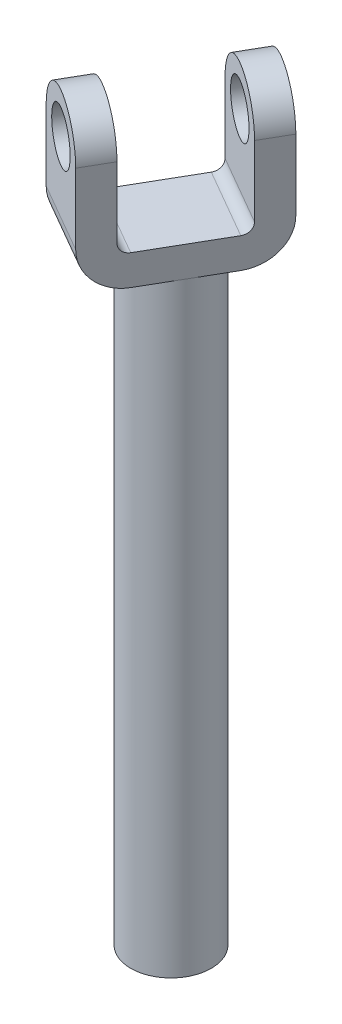
ISO-10303-21;
HEADER;
FILE_DESCRIPTION(('STEP AP214'),'2;1');
FILE_NAME('part.step','',(''),(''),'','','');
FILE_SCHEMA(('AUTOMOTIVE_DESIGN { 1 0 10303 214 1 1 1 1 }'));
ENDSEC;
DATA;
#1=APPLICATION_CONTEXT('core data for automotive mechanical design processes');
#2=APPLICATION_PROTOCOL_DEFINITION('international standard','automotive_design',2000,#1);
#3=PRODUCT_CONTEXT('',#1,'mechanical');
#4=PRODUCT('Part','Part','',(#3));
#5=PRODUCT_RELATED_PRODUCT_CATEGORY('part','',(#4));
#6=PRODUCT_DEFINITION_FORMATION('','',#4);
#7=PRODUCT_DEFINITION_CONTEXT('part definition',#1,'design');
#8=PRODUCT_DEFINITION('design','',#6,#7);
#9=PRODUCT_DEFINITION_SHAPE('','',#8);
#10=(LENGTH_UNIT() NAMED_UNIT(*) SI_UNIT(.MILLI.,.METRE.));
#11=(NAMED_UNIT(*) PLANE_ANGLE_UNIT() SI_UNIT($,.RADIAN.));
#12=(NAMED_UNIT(*) SI_UNIT($,.STERADIAN.) SOLID_ANGLE_UNIT());
#13=UNCERTAINTY_MEASURE_WITH_UNIT(LENGTH_MEASURE(1.E-05),#10,'distance_accuracy_value','');
#14=(GEOMETRIC_REPRESENTATION_CONTEXT(3) GLOBAL_UNCERTAINTY_ASSIGNED_CONTEXT((#13)) GLOBAL_UNIT_ASSIGNED_CONTEXT((#10,
#11,#12)) REPRESENTATION_CONTEXT('',''));
#15=CARTESIAN_POINT('',(0.,0.,0.));
#16=DIRECTION('',(0.,0.,1.));
#17=DIRECTION('',(1.,0.,0.));
#18=AXIS2_PLACEMENT_3D('',#15,#16,#17);
#19=CARTESIAN_POINT('',(30.34635,71.3137084989848,-52.5614200242678));
#20=DIRECTION('',(0.,-1.,0.));
#21=DIRECTION('',(0.,0.,-1.));
#22=AXIS2_PLACEMENT_3D('',#19,#20,#21);
#23=CYLINDRICAL_SURFACE('',#22,4.);
#24=CARTESIAN_POINT('',(30.34635,0.,-52.5614200242678));
#25=DIRECTION('',(0.,1.,0.));
#26=DIRECTION('',(0.,0.,1.));
#27=AXIS2_PLACEMENT_3D('',#24,#25,#26);
#28=CIRCLE('',#27,4.);
#29=CARTESIAN_POINT('',(30.34635,0.,-48.5614200242678));
#30=VERTEX_POINT('',#29);
#31=EDGE_CURVE('E264',#30,#30,#28,.T.);
#32=ORIENTED_EDGE('',*,*,#31,.T.);
#33=EDGE_LOOP('',(#32));
#34=FACE_BOUND('',#33,.T.);
#35=CARTESIAN_POINT('',(30.34635,60.,-52.5614200242678));
#36=DIRECTION('',(0.,1.,0.));
#37=DIRECTION('',(0.,0.,1.));
#38=AXIS2_PLACEMENT_3D('',#35,#36,#37);
#39=CIRCLE('',#38,4.);
#40=CARTESIAN_POINT('',(33.8104516151378,60.,-50.5614200242678));
#41=VERTEX_POINT('',#40);
#42=CARTESIAN_POINT('',(32.34635,60.,-56.0255216394055));
#43=VERTEX_POINT('',#42);
#44=EDGE_CURVE('E269',#41,#43,#39,.T.);
#45=ORIENTED_EDGE('',*,*,#44,.F.);
#46=CARTESIAN_POINT('',(28.34635,60.,-49.09731840913));
#47=VERTEX_POINT('',#46);
#48=EDGE_CURVE('E268',#47,#41,#39,.T.);
#49=ORIENTED_EDGE('',*,*,#48,.F.);
#50=CARTESIAN_POINT('',(26.8822483848622,60.,-54.5614200242678));
#51=VERTEX_POINT('',#50);
#52=EDGE_CURVE('E314',#51,#47,#39,.T.);
#53=ORIENTED_EDGE('',*,*,#52,.F.);
#54=EDGE_CURVE('E272',#43,#51,#39,.T.);
#55=ORIENTED_EDGE('',*,*,#54,.F.);
#56=EDGE_LOOP('',(#45,#49,#53,#55));
#57=FACE_BOUND('',#56,.T.);
#58=ADVANCED_FACE('F47',(#34,#57),#23,.T.);
#59=CARTESIAN_POINT('',(30.34635,0.,-52.5614200242678));
#60=DIRECTION('',(0.,1.,0.));
#61=DIRECTION('',(0.,0.,1.));
#62=AXIS2_PLACEMENT_3D('',#59,#60,#61);
#63=PLANE('',#62);
#64=ORIENTED_EDGE('',*,*,#31,.F.);
#65=EDGE_LOOP('',(#64));
#66=FACE_BOUND('',#65,.T.);
#67=ADVANCED_FACE('F351',(#66),#63,.F.);
#68=CARTESIAN_POINT('',(28.8822483848622,60.,-58.0255216394055));
#69=DIRECTION('',(0.,1.,0.));
#70=DIRECTION('',(0.,0.,1.));
#71=AXIS2_PLACEMENT_3D('',#68,#69,#70);
#72=PLANE('',#71);
#73=DIRECTION('',(-0.5,0.,0.866025403784439));
#74=VECTOR('',#73,1.);
#75=CARTESIAN_POINT('',(35.8104516151377,60.,-54.0255216394055));
#76=LINE('',#75,#74);
#77=CARTESIAN_POINT('',(35.8104516151377,60.,-54.0255216394055));
#78=VERTEX_POINT('',#77);
#79=EDGE_CURVE('E206',#78,#41,#76,.T.);
#80=ORIENTED_EDGE('',*,*,#79,.T.);
#81=ORIENTED_EDGE('',*,*,#44,.T.);
#82=DIRECTION('',(0.866025403784439,0.,0.5));
#83=VECTOR('',#82,1.);
#84=CARTESIAN_POINT('',(28.8822483848622,60.,-58.0255216394055));
#85=LINE('',#84,#83);
#86=EDGE_CURVE('E255',#43,#78,#85,.T.);
#87=ORIENTED_EDGE('',*,*,#86,.T.);
#88=EDGE_LOOP('',(#80,#81,#87));
#89=FACE_BOUND('',#88,.T.);
#90=ADVANCED_FACE('F326',(#89),#72,.F.);
#91=CARTESIAN_POINT('',(28.8822483848622,60.,-58.0255216394055));
#92=VERTEX_POINT('',#91);
#93=EDGE_CURVE('E256',#92,#43,#85,.T.);
#94=ORIENTED_EDGE('',*,*,#93,.T.);
#95=ORIENTED_EDGE('',*,*,#54,.T.);
#96=DIRECTION('',(-0.5,0.,0.866025403784439));
#97=VECTOR('',#96,1.);
#98=CARTESIAN_POINT('',(28.8822483848622,60.,-58.0255216394055));
#99=LINE('',#98,#97);
#100=EDGE_CURVE('E180',#92,#51,#99,.T.);
#101=ORIENTED_EDGE('',*,*,#100,.F.);
#102=EDGE_LOOP('',(#94,#95,#101));
#103=FACE_BOUND('',#102,.T.);
#104=ADVANCED_FACE('F365',(#103),#72,.F.);
#105=CARTESIAN_POINT('',(24.8822483848622,60.,-51.09731840913));
#106=VERTEX_POINT('',#105);
#107=EDGE_CURVE('E304',#51,#106,#99,.T.);
#108=ORIENTED_EDGE('',*,*,#107,.F.);
#109=ORIENTED_EDGE('',*,*,#52,.T.);
#110=DIRECTION('',(0.866025403784439,0.,0.5));
#111=VECTOR('',#110,1.);
#112=CARTESIAN_POINT('',(24.8822483848622,60.,-51.09731840913));
#113=LINE('',#112,#111);
#114=EDGE_CURVE('E251',#106,#47,#113,.T.);
#115=ORIENTED_EDGE('',*,*,#114,.F.);
#116=EDGE_LOOP('',(#108,#109,#115));
#117=FACE_BOUND('',#116,.T.);
#118=ADVANCED_FACE('F313',(#117),#72,.F.);
#119=CARTESIAN_POINT('',(30.8822483848622,75.,-61.4896232545433));
#120=DIRECTION('',(-0.5,0.,0.866025403784439));
#121=DIRECTION('',(0.866025403784439,0.,0.5));
#122=AXIS2_PLACEMENT_3D('',#119,#120,#121);
#123=PLANE('',#122);
#124=CARTESIAN_POINT('',(34.34635,71.,-59.4896232545433));
#125=DIRECTION('',(-0.5,0.,0.866025403784439));
#126=DIRECTION('',(0.866025403784439,0.,0.5));
#127=AXIS2_PLACEMENT_3D('',#124,#125,#126);
#128=CIRCLE('',#127,2.5);
#129=CARTESIAN_POINT('',(36.5114135094611,71.,-58.2396232545433));
#130=VERTEX_POINT('',#129);
#131=EDGE_CURVE('E201',#130,#130,#128,.T.);
#132=ORIENTED_EDGE('',*,*,#131,.T.);
#133=EDGE_LOOP('',(#132));
#134=FACE_BOUND('',#133,.T.);
#135=DIRECTION('',(0.,-1.,0.));
#136=VECTOR('',#135,1.);
#137=CARTESIAN_POINT('',(30.8822483848622,75.,-61.4896232545433));
#138=LINE('',#137,#136);
#139=CARTESIAN_POINT('',(30.8822483848622,71.,-61.4896232545433));
#140=VERTEX_POINT('',#139);
#141=CARTESIAN_POINT('',(30.8822483848622,64.,-61.4896232545433));
#142=VERTEX_POINT('',#141);
#143=EDGE_CURVE('E231',#140,#142,#138,.T.);
#144=ORIENTED_EDGE('',*,*,#143,.F.);
#145=CARTESIAN_POINT('',(34.34635,71.,-59.4896232545433));
#146=DIRECTION('',(-0.5,0.,0.866025403784439));
#147=DIRECTION('',(0.866025403784439,0.,0.5));
#148=AXIS2_PLACEMENT_3D('',#145,#146,#147);
#149=CIRCLE('',#148,3.99999999999999);
#150=CARTESIAN_POINT('',(37.8104516151377,71.,-57.4896232545433));
#151=VERTEX_POINT('',#150);
#152=EDGE_CURVE('E156',#140,#151,#149,.F.);
#153=ORIENTED_EDGE('',*,*,#152,.T.);
#154=DIRECTION('',(0.,-1.,0.));
#155=VECTOR('',#154,1.);
#156=CARTESIAN_POINT('',(37.8104516151377,75.,-57.4896232545433));
#157=LINE('',#156,#155);
#158=CARTESIAN_POINT('',(37.8104516151377,64.,-57.4896232545433));
#159=VERTEX_POINT('',#158);
#160=EDGE_CURVE('E197',#151,#159,#157,.T.);
#161=ORIENTED_EDGE('',*,*,#160,.T.);
#162=DIRECTION('',(0.866025403784439,0.,0.5));
#163=VECTOR('',#162,1.);
#164=CARTESIAN_POINT('',(30.8822483848622,64.,-61.4896232545433));
#165=LINE('',#164,#163);
#166=EDGE_CURVE('E260',#142,#159,#165,.T.);
#167=ORIENTED_EDGE('',*,*,#166,.F.);
#168=EDGE_LOOP('',(#144,#153,#161,#167));
#169=FACE_BOUND('',#168,.T.);
#170=ADVANCED_FACE('F337',(#134,#169),#123,.F.);
#171=CARTESIAN_POINT('',(28.8822483848622,64.,-58.0255216394055));
#172=DIRECTION('',(0.866025403784439,0.,0.5));
#173=DIRECTION('',(0.5,0.,-0.866025403784439));
#174=AXIS2_PLACEMENT_3D('',#171,#172,#173);
#175=CYLINDRICAL_SURFACE('',#174,3.99999999999999);
#176=CARTESIAN_POINT('',(35.8104516151377,64.,-54.0255216394055));
#177=DIRECTION('',(-0.866025403784439,0.,-0.5));
#178=DIRECTION('',(-0.5,0.,0.866025403784439));
#179=AXIS2_PLACEMENT_3D('',#176,#177,#178);
#180=CIRCLE('',#179,3.99999999999999);
#181=EDGE_CURVE('E200',#159,#78,#180,.T.);
#182=ORIENTED_EDGE('',*,*,#181,.T.);
#183=ORIENTED_EDGE('',*,*,#86,.F.);
#184=ORIENTED_EDGE('',*,*,#93,.F.);
#185=CARTESIAN_POINT('',(28.8822483848622,64.,-58.0255216394055));
#186=DIRECTION('',(-0.866025403784439,0.,-0.5));
#187=DIRECTION('',(-0.5,0.,0.866025403784439));
#188=AXIS2_PLACEMENT_3D('',#185,#186,#187);
#189=CIRCLE('',#188,3.99999999999999);
#190=EDGE_CURVE('E302',#142,#92,#189,.T.);
#191=ORIENTED_EDGE('',*,*,#190,.F.);
#192=ORIENTED_EDGE('',*,*,#166,.T.);
#193=EDGE_LOOP('',(#182,#183,#184,#191,#192));
#194=FACE_BOUND('',#193,.T.);
#195=ADVANCED_FACE('F331',(#194),#175,.T.);
#196=CARTESIAN_POINT('',(31.8104516151378,60.,-47.09731840913));
#197=VERTEX_POINT('',#196);
#198=EDGE_CURVE('E250',#47,#197,#113,.T.);
#199=ORIENTED_EDGE('',*,*,#198,.F.);
#200=ORIENTED_EDGE('',*,*,#48,.T.);
#201=EDGE_CURVE('E205',#41,#197,#76,.T.);
#202=ORIENTED_EDGE('',*,*,#201,.T.);
#203=EDGE_LOOP('',(#199,#200,#202));
#204=FACE_BOUND('',#203,.T.);
#205=ADVANCED_FACE('F360',(#204),#72,.F.);
#206=CARTESIAN_POINT('',(24.8822483848622,64.,-51.09731840913));
#207=DIRECTION('',(0.866025403784439,0.,0.5));
#208=DIRECTION('',(0.5,0.,-0.866025403784439));
#209=AXIS2_PLACEMENT_3D('',#206,#207,#208);
#210=CYLINDRICAL_SURFACE('',#209,3.99999999999999);
#211=CARTESIAN_POINT('',(31.8104516151378,64.,-47.09731840913));
#212=DIRECTION('',(-0.866025403784439,0.,-0.5));
#213=DIRECTION('',(-0.5,0.,0.866025403784439));
#214=AXIS2_PLACEMENT_3D('',#211,#212,#213);
#215=CIRCLE('',#214,3.99999999999999);
#216=CARTESIAN_POINT('',(29.8104516151378,64.,-43.6332167939923));
#217=VERTEX_POINT('',#216);
#218=EDGE_CURVE('E210',#197,#217,#215,.T.);
#219=ORIENTED_EDGE('',*,*,#218,.T.);
#220=DIRECTION('',(0.866025403784439,0.,0.5));
#221=VECTOR('',#220,1.);
#222=CARTESIAN_POINT('',(22.8822483848622,64.,-47.6332167939923));
#223=LINE('',#222,#221);
#224=CARTESIAN_POINT('',(22.8822483848622,64.,-47.6332167939923));
#225=VERTEX_POINT('',#224);
#226=EDGE_CURVE('E247',#225,#217,#223,.T.);
#227=ORIENTED_EDGE('',*,*,#226,.F.);
#228=CARTESIAN_POINT('',(24.8822483848622,64.,-51.09731840913));
#229=DIRECTION('',(-0.866025403784439,0.,-0.5));
#230=DIRECTION('',(-0.5,0.,0.866025403784439));
#231=AXIS2_PLACEMENT_3D('',#228,#229,#230);
#232=CIRCLE('',#231,3.99999999999999);
#233=EDGE_CURVE('E171',#106,#225,#232,.T.);
#234=ORIENTED_EDGE('',*,*,#233,.F.);
#235=ORIENTED_EDGE('',*,*,#114,.T.);
#236=ORIENTED_EDGE('',*,*,#198,.T.);
#237=EDGE_LOOP('',(#219,#227,#234,#235,#236));
#238=FACE_BOUND('',#237,.T.);
#239=ADVANCED_FACE('F317',(#238),#210,.T.);
#240=CARTESIAN_POINT('',(22.8822483848622,75.,-47.6332167939923));
#241=DIRECTION('',(0.5,0.,-0.866025403784439));
#242=DIRECTION('',(-0.866025403784439,0.,-0.5));
#243=AXIS2_PLACEMENT_3D('',#240,#241,#242);
#244=PLANE('',#243);
#245=CARTESIAN_POINT('',(26.34635,71.,-45.6332167939923));
#246=DIRECTION('',(0.5,0.,-0.866025403784439));
#247=DIRECTION('',(-0.866025403784439,0.,-0.5));
#248=AXIS2_PLACEMENT_3D('',#245,#246,#247);
#249=CIRCLE('',#248,2.5);
#250=CARTESIAN_POINT('',(24.1812864905389,71.,-46.8832167939923));
#251=VERTEX_POINT('',#250);
#252=EDGE_CURVE('E293',#251,#251,#249,.T.);
#253=ORIENTED_EDGE('',*,*,#252,.T.);
#254=EDGE_LOOP('',(#253));
#255=FACE_BOUND('',#254,.T.);
#256=DIRECTION('',(0.,1.,0.));
#257=VECTOR('',#256,1.);
#258=CARTESIAN_POINT('',(29.8104516151377,75.,-43.6332167939923));
#259=LINE('',#258,#257);
#260=CARTESIAN_POINT('',(29.8104516151378,71.,-43.6332167939923));
#261=VERTEX_POINT('',#260);
#262=EDGE_CURVE('E154',#217,#261,#259,.T.);
#263=ORIENTED_EDGE('',*,*,#262,.T.);
#264=CARTESIAN_POINT('',(26.34635,71.,-45.6332167939923));
#265=DIRECTION('',(0.5,0.,-0.866025403784439));
#266=DIRECTION('',(-0.866025403784439,0.,-0.5));
#267=AXIS2_PLACEMENT_3D('',#264,#265,#266);
#268=CIRCLE('',#267,3.99999999999999);
#269=CARTESIAN_POINT('',(22.8822483848623,71.,-47.6332167939923));
#270=VERTEX_POINT('',#269);
#271=EDGE_CURVE('E63',#261,#270,#268,.F.);
#272=ORIENTED_EDGE('',*,*,#271,.T.);
#273=DIRECTION('',(0.,1.,0.));
#274=VECTOR('',#273,1.);
#275=CARTESIAN_POINT('',(22.8822483848622,75.,-47.6332167939923));
#276=LINE('',#275,#274);
#277=EDGE_CURVE('E152',#225,#270,#276,.T.);
#278=ORIENTED_EDGE('',*,*,#277,.F.);
#279=ORIENTED_EDGE('',*,*,#226,.T.);
#280=EDGE_LOOP('',(#263,#272,#278,#279));
#281=FACE_BOUND('',#280,.T.);
#282=ADVANCED_FACE('F149',(#255,#281),#244,.F.);
#283=CARTESIAN_POINT('',(24.3822483848622,75.,-50.2312930053456));
#284=DIRECTION('',(-0.5,0.,0.866025403784439));
#285=DIRECTION('',(0.866025403784439,0.,0.5));
#286=AXIS2_PLACEMENT_3D('',#283,#284,#285);
#287=PLANE('',#286);
#288=CARTESIAN_POINT('',(27.84635,71.,-48.2312930053456));
#289=DIRECTION('',(-0.5,0.,0.866025403784439));
#290=DIRECTION('',(0.866025403784439,0.,0.5));
#291=AXIS2_PLACEMENT_3D('',#288,#289,#290);
#292=CIRCLE('',#291,2.5);
#293=CARTESIAN_POINT('',(30.0114135094611,71.,-46.9812930053456));
#294=VERTEX_POINT('',#293);
#295=EDGE_CURVE('E289',#294,#294,#292,.T.);
#296=ORIENTED_EDGE('',*,*,#295,.T.);
#297=EDGE_LOOP('',(#296));
#298=FACE_BOUND('',#297,.T.);
#299=DIRECTION('',(0.,-1.,0.));
#300=VECTOR('',#299,1.);
#301=CARTESIAN_POINT('',(24.3822483848622,75.,-50.2312930053456));
#302=LINE('',#301,#300);
#303=CARTESIAN_POINT('',(24.3822483848622,71.,-50.2312930053456));
#304=VERTEX_POINT('',#303);
#305=CARTESIAN_POINT('',(24.3822483848622,64.,-50.2312930053456));
#306=VERTEX_POINT('',#305);
#307=EDGE_CURVE('E174',#304,#306,#302,.T.);
#308=ORIENTED_EDGE('',*,*,#307,.F.);
#309=CARTESIAN_POINT('',(27.84635,71.,-48.2312930053456));
#310=DIRECTION('',(-0.5,0.,0.866025403784439));
#311=DIRECTION('',(0.866025403784439,0.,0.5));
#312=AXIS2_PLACEMENT_3D('',#309,#310,#311);
#313=CIRCLE('',#312,3.99999999999999);
#314=CARTESIAN_POINT('',(31.3104516151377,71.,-46.2312930053456));
#315=VERTEX_POINT('',#314);
#316=EDGE_CURVE('E157',#304,#315,#313,.F.);
#317=ORIENTED_EDGE('',*,*,#316,.T.);
#318=DIRECTION('',(0.,-1.,0.));
#319=VECTOR('',#318,1.);
#320=CARTESIAN_POINT('',(31.3104516151378,75.,-46.2312930053456));
#321=LINE('',#320,#319);
#322=CARTESIAN_POINT('',(31.3104516151378,64.,-46.2312930053456));
#323=VERTEX_POINT('',#322);
#324=EDGE_CURVE('E215',#315,#323,#321,.T.);
#325=ORIENTED_EDGE('',*,*,#324,.T.);
#326=DIRECTION('',(0.866025403784439,0.,0.5));
#327=VECTOR('',#326,1.);
#328=CARTESIAN_POINT('',(24.3822483848622,64.,-50.2312930053456));
#329=LINE('',#328,#327);
#330=EDGE_CURVE('E243',#306,#323,#329,.T.);
#331=ORIENTED_EDGE('',*,*,#330,.F.);
#332=EDGE_LOOP('',(#308,#317,#325,#331));
#333=FACE_BOUND('',#332,.T.);
#334=ADVANCED_FACE('F281',(#298,#333),#287,.F.);
#335=CARTESIAN_POINT('',(24.8822483848622,64.,-51.09731840913));
#336=DIRECTION('',(0.866025403784439,0.,0.5));
#337=DIRECTION('',(0.5,0.,-0.866025403784439));
#338=AXIS2_PLACEMENT_3D('',#335,#336,#337);
#339=CYLINDRICAL_SURFACE('',#338,1.);
#340=CARTESIAN_POINT('',(31.8104516151378,64.,-47.09731840913));
#341=DIRECTION('',(0.866025403784439,0.,0.5));
#342=DIRECTION('',(-0.5,0.,0.866025403784439));
#343=AXIS2_PLACEMENT_3D('',#340,#341,#342);
#344=CIRCLE('',#343,1.);
#345=CARTESIAN_POINT('',(31.8104516151378,63.,-47.09731840913));
#346=VERTEX_POINT('',#345);
#347=EDGE_CURVE('E218',#323,#346,#344,.T.);
#348=ORIENTED_EDGE('',*,*,#347,.T.);
#349=DIRECTION('',(0.866025403784439,0.,0.5));
#350=VECTOR('',#349,1.);
#351=CARTESIAN_POINT('',(24.8822483848622,63.,-51.09731840913));
#352=LINE('',#351,#350);
#353=CARTESIAN_POINT('',(24.8822483848622,63.,-51.09731840913));
#354=VERTEX_POINT('',#353);
#355=EDGE_CURVE('E239',#354,#346,#352,.T.);
#356=ORIENTED_EDGE('',*,*,#355,.F.);
#357=CARTESIAN_POINT('',(24.8822483848622,64.,-51.09731840913));
#358=DIRECTION('',(0.866025403784439,0.,0.5));
#359=DIRECTION('',(-0.5,0.,0.866025403784439));
#360=AXIS2_PLACEMENT_3D('',#357,#358,#359);
#361=CIRCLE('',#360,1.);
#362=EDGE_CURVE('E178',#306,#354,#361,.T.);
#363=ORIENTED_EDGE('',*,*,#362,.F.);
#364=ORIENTED_EDGE('',*,*,#330,.T.);
#365=EDGE_LOOP('',(#348,#356,#363,#364));
#366=FACE_BOUND('',#365,.T.);
#367=ADVANCED_FACE('F383',(#366),#339,.F.);
#368=CARTESIAN_POINT('',(28.8822483848622,63.,-58.0255216394055));
#369=DIRECTION('',(0.,-1.,0.));
#370=DIRECTION('',(0.,0.,-1.));
#371=AXIS2_PLACEMENT_3D('',#368,#369,#370);
#372=PLANE('',#371);
#373=DIRECTION('',(0.5,0.,-0.866025403784439));
#374=VECTOR('',#373,1.);
#375=CARTESIAN_POINT('',(35.8104516151377,63.,-54.0255216394055));
#376=LINE('',#375,#374);
#377=CARTESIAN_POINT('',(35.8104516151377,63.,-54.0255216394055));
#378=VERTEX_POINT('',#377);
#379=EDGE_CURVE('E221',#346,#378,#376,.T.);
#380=ORIENTED_EDGE('',*,*,#379,.T.);
#381=DIRECTION('',(0.866025403784439,0.,0.5));
#382=VECTOR('',#381,1.);
#383=CARTESIAN_POINT('',(28.8822483848622,63.,-58.0255216394055));
#384=LINE('',#383,#382);
#385=CARTESIAN_POINT('',(28.8822483848622,63.,-58.0255216394055));
#386=VERTEX_POINT('',#385);
#387=EDGE_CURVE('E235',#386,#378,#384,.T.);
#388=ORIENTED_EDGE('',*,*,#387,.F.);
#389=DIRECTION('',(0.5,0.,-0.866025403784439));
#390=VECTOR('',#389,1.);
#391=CARTESIAN_POINT('',(28.8822483848622,63.,-58.0255216394055));
#392=LINE('',#391,#390);
#393=EDGE_CURVE('E186',#354,#386,#392,.T.);
#394=ORIENTED_EDGE('',*,*,#393,.F.);
#395=ORIENTED_EDGE('',*,*,#355,.T.);
#396=EDGE_LOOP('',(#380,#388,#394,#395));
#397=FACE_BOUND('',#396,.T.);
#398=ADVANCED_FACE('F379',(#397),#372,.F.);
#399=CARTESIAN_POINT('',(28.8822483848622,64.,-58.0255216394055));
#400=DIRECTION('',(0.866025403784439,0.,0.5));
#401=DIRECTION('',(0.5,0.,-0.866025403784439));
#402=AXIS2_PLACEMENT_3D('',#399,#400,#401);
#403=CYLINDRICAL_SURFACE('',#402,0.999999999999999);
#404=CARTESIAN_POINT('',(35.8104516151377,64.,-54.0255216394055));
#405=DIRECTION('',(0.866025403784439,0.,0.5));
#406=DIRECTION('',(-0.5,0.,0.866025403784439));
#407=AXIS2_PLACEMENT_3D('',#404,#405,#406);
#408=CIRCLE('',#407,0.999999999999999);
#409=CARTESIAN_POINT('',(36.3104516151377,64.,-54.89154704319));
#410=VERTEX_POINT('',#409);
#411=EDGE_CURVE('E224',#378,#410,#408,.T.);
#412=ORIENTED_EDGE('',*,*,#411,.T.);
#413=DIRECTION('',(0.866025403784439,0.,0.5));
#414=VECTOR('',#413,1.);
#415=CARTESIAN_POINT('',(29.3822483848622,64.,-58.89154704319));
#416=LINE('',#415,#414);
#417=CARTESIAN_POINT('',(29.3822483848622,64.,-58.89154704319));
#418=VERTEX_POINT('',#417);
#419=EDGE_CURVE('E196',#418,#410,#416,.T.);
#420=ORIENTED_EDGE('',*,*,#419,.F.);
#421=CARTESIAN_POINT('',(28.8822483848622,64.,-58.0255216394055));
#422=DIRECTION('',(0.866025403784439,0.,0.5));
#423=DIRECTION('',(-0.5,0.,0.866025403784439));
#424=AXIS2_PLACEMENT_3D('',#421,#422,#423);
#425=CIRCLE('',#424,0.999999999999999);
#426=EDGE_CURVE('E189',#386,#418,#425,.T.);
#427=ORIENTED_EDGE('',*,*,#426,.F.);
#428=ORIENTED_EDGE('',*,*,#387,.T.);
#429=EDGE_LOOP('',(#412,#420,#427,#428));
#430=FACE_BOUND('',#429,.T.);
#431=ADVANCED_FACE('F375',(#430),#403,.F.);
#432=CARTESIAN_POINT('',(29.3822483848622,75.,-58.89154704319));
#433=DIRECTION('',(0.5,0.,-0.866025403784439));
#434=DIRECTION('',(-0.866025403784439,0.,-0.5));
#435=AXIS2_PLACEMENT_3D('',#432,#433,#434);
#436=PLANE('',#435);
#437=CARTESIAN_POINT('',(32.84635,71.,-56.89154704319));
#438=DIRECTION('',(0.5,0.,-0.866025403784439));
#439=DIRECTION('',(-0.866025403784439,0.,-0.5));
#440=AXIS2_PLACEMENT_3D('',#437,#438,#439);
#441=CIRCLE('',#440,2.5);
#442=CARTESIAN_POINT('',(30.6812864905389,71.,-58.14154704319));
#443=VERTEX_POINT('',#442);
#444=EDGE_CURVE('E50',#443,#443,#441,.T.);
#445=ORIENTED_EDGE('',*,*,#444,.T.);
#446=EDGE_LOOP('',(#445));
#447=FACE_BOUND('',#446,.T.);
#448=DIRECTION('',(0.,1.,0.));
#449=VECTOR('',#448,1.);
#450=CARTESIAN_POINT('',(36.3104516151377,75.,-54.89154704319));
#451=LINE('',#450,#449);
#452=CARTESIAN_POINT('',(36.3104516151377,71.,-54.89154704319));
#453=VERTEX_POINT('',#452);
#454=EDGE_CURVE('E227',#410,#453,#451,.T.);
#455=ORIENTED_EDGE('',*,*,#454,.T.);
#456=CARTESIAN_POINT('',(32.84635,71.,-56.89154704319));
#457=DIRECTION('',(0.5,0.,-0.866025403784439));
#458=DIRECTION('',(-0.866025403784439,0.,-0.5));
#459=AXIS2_PLACEMENT_3D('',#456,#457,#458);
#460=CIRCLE('',#459,3.99999999999999);
#461=CARTESIAN_POINT('',(29.3822483848622,71.,-58.89154704319));
#462=VERTEX_POINT('',#461);
#463=EDGE_CURVE('E71',#453,#462,#460,.F.);
#464=ORIENTED_EDGE('',*,*,#463,.T.);
#465=DIRECTION('',(0.,1.,0.));
#466=VECTOR('',#465,1.);
#467=CARTESIAN_POINT('',(29.3822483848622,75.,-58.89154704319));
#468=LINE('',#467,#466);
#469=EDGE_CURVE('E192',#418,#462,#468,.T.);
#470=ORIENTED_EDGE('',*,*,#469,.F.);
#471=ORIENTED_EDGE('',*,*,#419,.T.);
#472=EDGE_LOOP('',(#455,#464,#470,#471));
#473=FACE_BOUND('',#472,.T.);
#474=ADVANCED_FACE('F371',(#447,#473),#436,.F.);
#475=CARTESIAN_POINT('',(28.8822483848622,64.,-58.0255216394055));
#476=DIRECTION('',(-0.866025403784439,0.,-0.5));
#477=DIRECTION('',(-0.5,0.,0.866025403784439));
#478=AXIS2_PLACEMENT_3D('',#475,#476,#477);
#479=PLANE('',#478);
#480=DIRECTION('',(0.5,0.,-0.866025403784439));
#481=VECTOR('',#480,1.);
#482=CARTESIAN_POINT('',(21.1501975772934,71.,-44.6332167939923));
#483=LINE('',#482,#481);
#484=EDGE_CURVE('E166',#462,#140,#483,.T.);
#485=ORIENTED_EDGE('',*,*,#484,.T.);
#486=ORIENTED_EDGE('',*,*,#143,.T.);
#487=ORIENTED_EDGE('',*,*,#190,.T.);
#488=ORIENTED_EDGE('',*,*,#100,.T.);
#489=ORIENTED_EDGE('',*,*,#107,.T.);
#490=ORIENTED_EDGE('',*,*,#233,.T.);
#491=ORIENTED_EDGE('',*,*,#277,.T.);
#492=EDGE_CURVE('E160',#270,#304,#483,.T.);
#493=ORIENTED_EDGE('',*,*,#492,.T.);
#494=ORIENTED_EDGE('',*,*,#307,.T.);
#495=ORIENTED_EDGE('',*,*,#362,.T.);
#496=ORIENTED_EDGE('',*,*,#393,.T.);
#497=ORIENTED_EDGE('',*,*,#426,.T.);
#498=ORIENTED_EDGE('',*,*,#469,.T.);
#499=EDGE_LOOP('',(#485,#486,#487,#488,#489,#490,#491,#493,#494,#495,#496,#497,#498));
#500=FACE_BOUND('',#499,.T.);
#501=ADVANCED_FACE('F169',(#500),#479,.T.);
#502=CARTESIAN_POINT('',(35.8104516151377,64.,-54.0255216394055));
#503=DIRECTION('',(-0.866025403784439,0.,-0.5));
#504=DIRECTION('',(-0.5,0.,0.866025403784439));
#505=AXIS2_PLACEMENT_3D('',#502,#503,#504);
#506=PLANE('',#505);
#507=ORIENTED_EDGE('',*,*,#160,.F.);
#508=DIRECTION('',(0.5,0.,-0.866025403784439));
#509=VECTOR('',#508,1.);
#510=CARTESIAN_POINT('',(28.0784008075689,71.,-40.6332167939923));
#511=LINE('',#510,#509);
#512=EDGE_CURVE('E11',#151,#453,#511,.F.);
#513=ORIENTED_EDGE('',*,*,#512,.T.);
#514=ORIENTED_EDGE('',*,*,#454,.F.);
#515=ORIENTED_EDGE('',*,*,#411,.F.);
#516=ORIENTED_EDGE('',*,*,#379,.F.);
#517=ORIENTED_EDGE('',*,*,#347,.F.);
#518=ORIENTED_EDGE('',*,*,#324,.F.);
#519=EDGE_CURVE('E56',#315,#261,#511,.F.);
#520=ORIENTED_EDGE('',*,*,#519,.T.);
#521=ORIENTED_EDGE('',*,*,#262,.F.);
#522=ORIENTED_EDGE('',*,*,#218,.F.);
#523=ORIENTED_EDGE('',*,*,#201,.F.);
#524=ORIENTED_EDGE('',*,*,#79,.F.);
#525=ORIENTED_EDGE('',*,*,#181,.F.);
#526=EDGE_LOOP('',(#507,#513,#514,#515,#516,#517,#518,#520,#521,#522,#523,#524,#525));
#527=FACE_BOUND('',#526,.T.);
#528=ADVANCED_FACE('F277',(#527),#506,.F.);
#529=CARTESIAN_POINT('',(24.6142991924311,71.,-42.6332167939923));
#530=DIRECTION('',(0.5,0.,-0.866025403784439));
#531=DIRECTION('',(-0.866025403784439,0.,-0.5));
#532=AXIS2_PLACEMENT_3D('',#529,#530,#531);
#533=CYLINDRICAL_SURFACE('',#532,3.99999999999999);
#534=ORIENTED_EDGE('',*,*,#519,.F.);
#535=ORIENTED_EDGE('',*,*,#316,.F.);
#536=ORIENTED_EDGE('',*,*,#492,.F.);
#537=ORIENTED_EDGE('',*,*,#271,.F.);
#538=EDGE_LOOP('',(#534,#535,#536,#537));
#539=FACE_BOUND('',#538,.T.);
#540=ADVANCED_FACE('F161',(#539),#533,.T.);
#541=ORIENTED_EDGE('',*,*,#484,.F.);
#542=ORIENTED_EDGE('',*,*,#463,.F.);
#543=ORIENTED_EDGE('',*,*,#512,.F.);
#544=ORIENTED_EDGE('',*,*,#152,.F.);
#545=EDGE_LOOP('',(#541,#542,#543,#544));
#546=FACE_BOUND('',#545,.T.);
#547=ADVANCED_FACE('F339',(#546),#533,.T.);
#548=CARTESIAN_POINT('',(24.6142991924311,71.,-42.6332167939923));
#549=DIRECTION('',(0.5,0.,-0.866025403784439));
#550=DIRECTION('',(-0.866025403784439,0.,-0.5));
#551=AXIS2_PLACEMENT_3D('',#548,#549,#550);
#552=CYLINDRICAL_SURFACE('',#551,2.5);
#553=ORIENTED_EDGE('',*,*,#444,.F.);
#554=EDGE_LOOP('',(#553));
#555=FACE_BOUND('',#554,.T.);
#556=ORIENTED_EDGE('',*,*,#131,.F.);
#557=EDGE_LOOP('',(#556));
#558=FACE_BOUND('',#557,.T.);
#559=ADVANCED_FACE('F341',(#555,#558),#552,.F.);
#560=ORIENTED_EDGE('',*,*,#295,.F.);
#561=EDGE_LOOP('',(#560));
#562=FACE_BOUND('',#561,.T.);
#563=ORIENTED_EDGE('',*,*,#252,.F.);
#564=EDGE_LOOP('',(#563));
#565=FACE_BOUND('',#564,.T.);
#566=ADVANCED_FACE('F347',(#562,#565),#552,.F.);
#567=CLOSED_SHELL('',(#58,#67,#90,#104,#118,#170,#195,#205,#239,#282,#334,#367,#398,#431,#474,
#501,#528,#540,#547,#559,#566));
#568=MANIFOLD_SOLID_BREP('B2',#567);
#569=ADVANCED_BREP_SHAPE_REPRESENTATION('',(#18,#568),#14);
#570=SHAPE_DEFINITION_REPRESENTATION(#9,#569);
ENDSEC;
END-ISO-10303-21;
